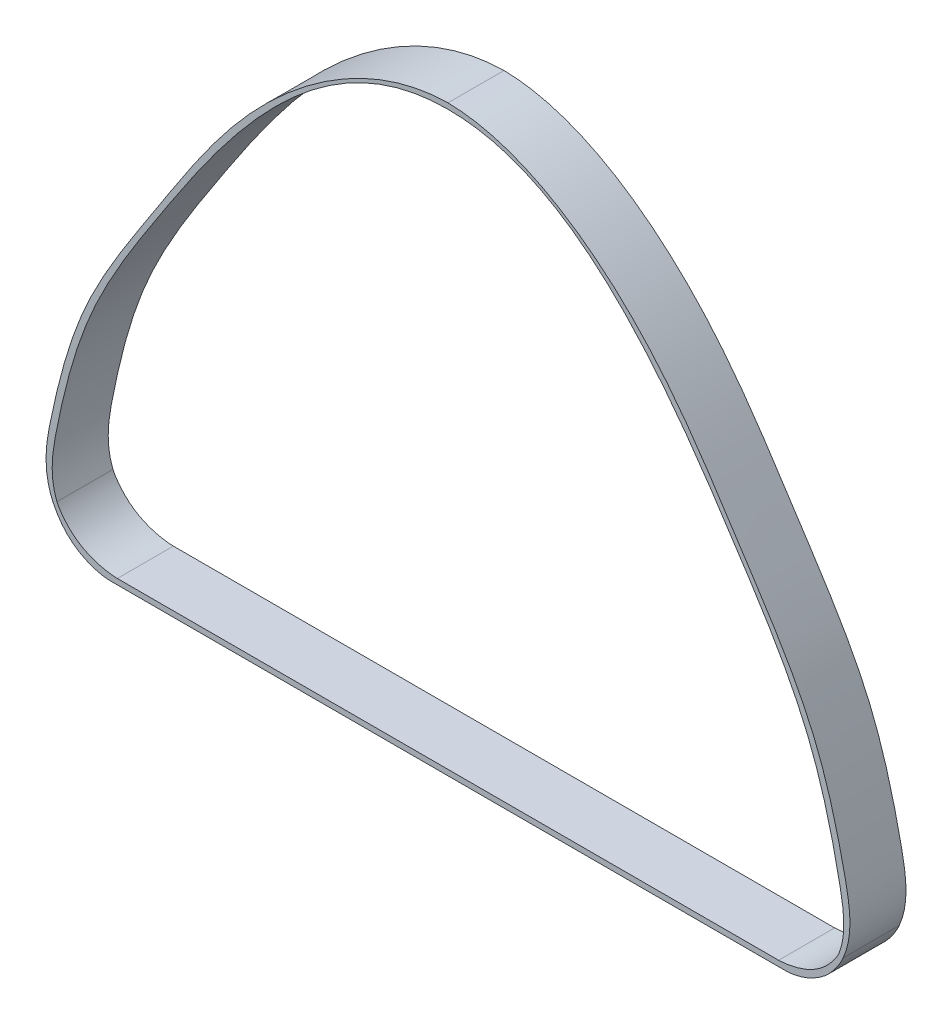
ISO-10303-21;
HEADER;
FILE_DESCRIPTION(('STEP AP214'),'2;1');
FILE_NAME('part.step','',(''),(''),'','','');
FILE_SCHEMA(('AUTOMOTIVE_DESIGN { 1 0 10303 214 1 1 1 1 }'));
ENDSEC;
DATA;
#1=APPLICATION_CONTEXT('core data for automotive mechanical design processes');
#2=APPLICATION_PROTOCOL_DEFINITION('international standard','automotive_design',2000,#1);
#3=PRODUCT_CONTEXT('',#1,'mechanical');
#4=PRODUCT('Part','Part','',(#3));
#5=PRODUCT_RELATED_PRODUCT_CATEGORY('part','',(#4));
#6=PRODUCT_DEFINITION_FORMATION('','',#4);
#7=PRODUCT_DEFINITION_CONTEXT('part definition',#1,'design');
#8=PRODUCT_DEFINITION('design','',#6,#7);
#9=PRODUCT_DEFINITION_SHAPE('','',#8);
#10=(LENGTH_UNIT() NAMED_UNIT(*) SI_UNIT(.MILLI.,.METRE.));
#11=(NAMED_UNIT(*) PLANE_ANGLE_UNIT() SI_UNIT($,.RADIAN.));
#12=(NAMED_UNIT(*) SI_UNIT($,.STERADIAN.) SOLID_ANGLE_UNIT());
#13=UNCERTAINTY_MEASURE_WITH_UNIT(LENGTH_MEASURE(1.E-05),#10,'distance_accuracy_value','');
#14=(GEOMETRIC_REPRESENTATION_CONTEXT(3) GLOBAL_UNCERTAINTY_ASSIGNED_CONTEXT((#13)) GLOBAL_UNIT_ASSIGNED_CONTEXT((#10,
#11,#12)) REPRESENTATION_CONTEXT('',''));
#15=CARTESIAN_POINT('',(0.,0.,0.));
#16=DIRECTION('',(0.,0.,1.));
#17=DIRECTION('',(1.,0.,0.));
#18=AXIS2_PLACEMENT_3D('',#15,#16,#17);
#19=CARTESIAN_POINT('',(24.6814928808751,12.8843236164375,5.));
#20=DIRECTION('',(0.,0.,1.));
#21=DIRECTION('',(1.,0.,0.));
#22=AXIS2_PLACEMENT_3D('',#19,#20,#21);
#23=PLANE('',#22);
#24=CARTESIAN_POINT('',(35.2584368437434,-16.4412791148118,5.));
#25=CARTESIAN_POINT('',(36.2300611856856,-14.2120162556952,5.));
#26=CARTESIAN_POINT('',(35.2635909123545,-8.86453883683733,5.));
#27=CARTESIAN_POINT('',(32.7911731615511,0.606888672938726,5.));
#28=CARTESIAN_POINT('',(25.7176322990285,11.1374464392121,5.));
#29=CARTESIAN_POINT('',(17.5035133605746,24.3306932764224,5.));
#30=CARTESIAN_POINT('',(6.52553134181208,31.9035956706368,5.));
#31=CARTESIAN_POINT('',(0.,32.,5.));
#32=B_SPLINE_CURVE_WITH_KNOTS('',3,(#24,#25,#26,#27,#28,#29,#30,#31),.UNSPECIFIED.,.F.,.F.,(4,1,
1,1,1,4),(0.,0.101815778200956,0.254593468675808,0.456472378289915,0.689238128462499,1.),.UNSPECIFIED.);
#33=CARTESIAN_POINT('',(35.2584368437434,-16.4412791148118,5.));
#34=VERTEX_POINT('',#33);
#35=CARTESIAN_POINT('',(0.,32.,5.));
#36=VERTEX_POINT('',#35);
#37=EDGE_CURVE('E224',#34,#36,#32,.T.);
#38=ORIENTED_EDGE('',*,*,#37,.T.);
#39=CARTESIAN_POINT('',(0.,32.,5.));
#40=CARTESIAN_POINT('',(-6.52553134181209,31.9035956706368,5.));
#41=CARTESIAN_POINT('',(-17.5035133605746,24.3306932764224,5.));
#42=CARTESIAN_POINT('',(-25.7176322990285,11.1374464392121,5.));
#43=CARTESIAN_POINT('',(-32.7911731615511,0.60688867293871,5.));
#44=CARTESIAN_POINT('',(-35.2635909123545,-8.86453883683735,5.));
#45=CARTESIAN_POINT('',(-36.2300611856856,-14.2120162556952,5.));
#46=CARTESIAN_POINT('',(-35.2584368437434,-16.4412791148118,5.));
#47=B_SPLINE_CURVE_WITH_KNOTS('',3,(#39,#40,#41,#42,#43,#44,#45,#46),.UNSPECIFIED.,.F.,.F.,(4,1,
1,1,1,4),(0.,0.310761871537501,0.543527621710084,0.745406531324192,0.898184221799044,1.),.UNSPECIFIED.);
#48=CARTESIAN_POINT('',(-35.2584368437434,-16.4412791148118,5.));
#49=VERTEX_POINT('',#48);
#50=EDGE_CURVE('E262',#36,#49,#47,.T.);
#51=ORIENTED_EDGE('',*,*,#50,.T.);
#52=CARTESIAN_POINT('',(-35.2584368437434,-16.4412791148118,5.));
#53=CARTESIAN_POINT('',(-34.9964434209078,-17.0209088515704,5.));
#54=CARTESIAN_POINT('',(-33.6905561455173,-19.1425610901067,5.));
#55=CARTESIAN_POINT('',(-31.1853546864803,-20.0293160233538,5.));
#56=CARTESIAN_POINT('',(-30.,-20.,5.));
#57=B_SPLINE_CURVE_WITH_KNOTS('',3,(#52,#53,#54,#55,#56),.UNSPECIFIED.,.F.,.F.,(4,1,4),(0.,
0.359900696386302,1.),.UNSPECIFIED.);
#58=CARTESIAN_POINT('',(-30.,-20.,5.));
#59=VERTEX_POINT('',#58);
#60=EDGE_CURVE('E246',#49,#59,#57,.T.);
#61=ORIENTED_EDGE('',*,*,#60,.T.);
#62=DIRECTION('',(1.,0.,0.));
#63=VECTOR('',#62,1.);
#64=CARTESIAN_POINT('',(-30.,-20.,5.));
#65=LINE('',#64,#63);
#66=CARTESIAN_POINT('',(30.,-20.,5.));
#67=VERTEX_POINT('',#66);
#68=EDGE_CURVE('E187',#59,#67,#65,.T.);
#69=ORIENTED_EDGE('',*,*,#68,.T.);
#70=CARTESIAN_POINT('',(30.,-20.,5.));
#71=CARTESIAN_POINT('',(31.1853546864803,-20.0293160233538,5.));
#72=CARTESIAN_POINT('',(33.6905561455173,-19.1425610901067,5.));
#73=CARTESIAN_POINT('',(34.9964434209078,-17.0209088515704,5.));
#74=CARTESIAN_POINT('',(35.2584368437434,-16.4412791148118,5.));
#75=B_SPLINE_CURVE_WITH_KNOTS('',3,(#70,#71,#72,#73,#74),.UNSPECIFIED.,.F.,.F.,(4,1,4),(0.,
0.640099303613698,1.),.UNSPECIFIED.);
#76=EDGE_CURVE('E179',#67,#34,#75,.T.);
#77=ORIENTED_EDGE('',*,*,#76,.T.);
#78=EDGE_LOOP('',(#38,#51,#61,#69,#77));
#79=FACE_BOUND('',#78,.T.);
#80=CARTESIAN_POINT('',(-34.8901272655465,-16.2695335379268,5.));
#81=CARTESIAN_POINT('',(-34.6657296001164,-16.7781174900036,5.));
#82=CARTESIAN_POINT('',(-33.0754771775325,-18.9212695446817,5.));
#83=CARTESIAN_POINT('',(-30.5488039096482,-19.479382043201,5.));
#84=CARTESIAN_POINT('',(-29.5,-19.5,5.));
#85=B_SPLINE_CURVE_WITH_KNOTS('',3,(#80,#81,#82,#83,#84),.UNSPECIFIED.,.F.,.F.,(4,1,4),(0.,
0.376949425999424,1.),.UNSPECIFIED.);
#86=CARTESIAN_POINT('',(-34.8901272655465,-16.2695335379268,5.));
#87=VERTEX_POINT('',#86);
#88=CARTESIAN_POINT('',(-29.5,-19.5,5.));
#89=VERTEX_POINT('',#88);
#90=EDGE_CURVE('E127',#87,#89,#85,.T.);
#91=ORIENTED_EDGE('',*,*,#90,.F.);
#92=CARTESIAN_POINT('',(0.,31.5,5.));
#93=CARTESIAN_POINT('',(-7.2551093928789,31.5111403772145,5.));
#94=CARTESIAN_POINT('',(-16.9533330913809,23.7158654788186,5.));
#95=CARTESIAN_POINT('',(-25.440161273381,10.9419992170632,5.));
#96=CARTESIAN_POINT('',(-32.2811165735658,0.338428352969211,5.));
#97=CARTESIAN_POINT('',(-34.6768934890413,-8.99115463249299,5.));
#98=CARTESIAN_POINT('',(-35.6048351831951,-14.4291149877429,5.));
#99=CARTESIAN_POINT('',(-34.8901272655465,-16.2695335379268,5.));
#100=B_SPLINE_CURVE_WITH_KNOTS('',3,(#92,#93,#94,#95,#96,#97,#98,#99),.UNSPECIFIED.,.F.,.F.,(4,
1,1,1,1,4),(0.,0.317686175826545,0.539497045980658,0.743916362264332,0.910983569282216,1.),.UNSPECIFIED.);
#101=CARTESIAN_POINT('',(0.,31.5,5.));
#102=VERTEX_POINT('',#101);
#103=EDGE_CURVE('E118',#102,#87,#100,.T.);
#104=ORIENTED_EDGE('',*,*,#103,.F.);
#105=CARTESIAN_POINT('',(34.8901272655465,-16.2695335379268,5.));
#106=CARTESIAN_POINT('',(35.6048351831951,-14.4291149877429,5.));
#107=CARTESIAN_POINT('',(34.6768934890413,-8.99115463249299,5.));
#108=CARTESIAN_POINT('',(32.2811165735658,0.338428352969214,5.));
#109=CARTESIAN_POINT('',(25.440161273381,10.9419992170632,5.));
#110=CARTESIAN_POINT('',(16.9533330913809,23.7158654788186,5.));
#111=CARTESIAN_POINT('',(7.25510939287889,31.5111403772145,5.));
#112=CARTESIAN_POINT('',(0.,31.5,5.));
#113=B_SPLINE_CURVE_WITH_KNOTS('',3,(#105,#106,#107,#108,#109,#110,#111,#112),.UNSPECIFIED.,.F.,
.F.,(4,1,1,1,1,4),(0.,0.0890164307177842,0.256083637735668,0.460502954019342,0.682313824173455,
1.),.UNSPECIFIED.);
#114=CARTESIAN_POINT('',(34.8901272655465,-16.2695335379268,5.));
#115=VERTEX_POINT('',#114);
#116=EDGE_CURVE('E298',#115,#102,#113,.T.);
#117=ORIENTED_EDGE('',*,*,#116,.F.);
#118=CARTESIAN_POINT('',(29.5,-19.5,5.));
#119=CARTESIAN_POINT('',(30.5488039096482,-19.479382043201,5.));
#120=CARTESIAN_POINT('',(33.0754771775325,-18.9212695446817,5.));
#121=CARTESIAN_POINT('',(34.6657296001164,-16.7781174900036,5.));
#122=CARTESIAN_POINT('',(34.8901272655465,-16.2695335379268,5.));
#123=B_SPLINE_CURVE_WITH_KNOTS('',3,(#118,#119,#120,#121,#122),.UNSPECIFIED.,.F.,.F.,(4,1,4),
(0.,0.623050574000576,1.),.UNSPECIFIED.);
#124=CARTESIAN_POINT('',(29.5,-19.5,5.));
#125=VERTEX_POINT('',#124);
#126=EDGE_CURVE('E145',#125,#115,#123,.T.);
#127=ORIENTED_EDGE('',*,*,#126,.F.);
#128=DIRECTION('',(1.,0.,0.));
#129=VECTOR('',#128,1.);
#130=CARTESIAN_POINT('',(-29.5,-19.5,5.));
#131=LINE('',#130,#129);
#132=EDGE_CURVE('E141',#89,#125,#131,.T.);
#133=ORIENTED_EDGE('',*,*,#132,.F.);
#134=EDGE_LOOP('',(#91,#104,#117,#127,#133));
#135=FACE_BOUND('',#134,.T.);
#136=ADVANCED_FACE('F39',(#79,#135),#23,.T.);
#137=CARTESIAN_POINT('',(24.6814928808751,12.8843236164375,0.));
#138=DIRECTION('',(0.,0.,1.));
#139=DIRECTION('',(1.,0.,0.));
#140=AXIS2_PLACEMENT_3D('',#137,#138,#139);
#141=PLANE('',#140);
#142=CARTESIAN_POINT('',(35.2584368437434,-16.4412791148118,0.));
#143=CARTESIAN_POINT('',(36.2300611856856,-14.2120162556952,0.));
#144=CARTESIAN_POINT('',(35.2635909123545,-8.86453883683733,0.));
#145=CARTESIAN_POINT('',(32.7911731615511,0.606888672938726,0.));
#146=CARTESIAN_POINT('',(25.7176322990285,11.1374464392121,0.));
#147=CARTESIAN_POINT('',(17.5035133605746,24.3306932764224,0.));
#148=CARTESIAN_POINT('',(6.52553134181208,31.9035956706368,0.));
#149=CARTESIAN_POINT('',(0.,32.,0.));
#150=B_SPLINE_CURVE_WITH_KNOTS('',3,(#142,#143,#144,#145,#146,#147,#148,#149),.UNSPECIFIED.,.F.,
.F.,(4,1,1,1,1,4),(0.,0.101815778200956,0.254593468675808,0.456472378289915,0.689238128462499,
1.),.UNSPECIFIED.);
#151=CARTESIAN_POINT('',(35.2584368437434,-16.4412791148118,0.));
#152=VERTEX_POINT('',#151);
#153=CARTESIAN_POINT('',(0.,32.,0.));
#154=VERTEX_POINT('',#153);
#155=EDGE_CURVE('E136',#152,#154,#150,.T.);
#156=ORIENTED_EDGE('',*,*,#155,.F.);
#157=CARTESIAN_POINT('',(30.,-20.,0.));
#158=CARTESIAN_POINT('',(31.1853546864803,-20.0293160233538,0.));
#159=CARTESIAN_POINT('',(33.6905561455173,-19.1425610901067,0.));
#160=CARTESIAN_POINT('',(34.9964434209078,-17.0209088515704,0.));
#161=CARTESIAN_POINT('',(35.2584368437434,-16.4412791148118,0.));
#162=B_SPLINE_CURVE_WITH_KNOTS('',3,(#157,#158,#159,#160,#161),.UNSPECIFIED.,.F.,.F.,(4,1,4),
(0.,0.640099303613698,1.),.UNSPECIFIED.);
#163=CARTESIAN_POINT('',(30.,-20.,0.));
#164=VERTEX_POINT('',#163);
#165=EDGE_CURVE('E219',#164,#152,#162,.T.);
#166=ORIENTED_EDGE('',*,*,#165,.F.);
#167=DIRECTION('',(1.,0.,0.));
#168=VECTOR('',#167,1.);
#169=CARTESIAN_POINT('',(-30.,-20.,0.));
#170=LINE('',#169,#168);
#171=CARTESIAN_POINT('',(-30.,-20.,0.));
#172=VERTEX_POINT('',#171);
#173=EDGE_CURVE('E213',#172,#164,#170,.T.);
#174=ORIENTED_EDGE('',*,*,#173,.F.);
#175=CARTESIAN_POINT('',(-35.2584368437434,-16.4412791148118,0.));
#176=CARTESIAN_POINT('',(-34.9964434209078,-17.0209088515704,0.));
#177=CARTESIAN_POINT('',(-33.6905561455173,-19.1425610901067,0.));
#178=CARTESIAN_POINT('',(-31.1853546864803,-20.0293160233538,0.));
#179=CARTESIAN_POINT('',(-30.,-20.,0.));
#180=B_SPLINE_CURVE_WITH_KNOTS('',3,(#175,#176,#177,#178,#179),.UNSPECIFIED.,.F.,.F.,(4,1,4),
(0.,0.359900696386302,1.),.UNSPECIFIED.);
#181=CARTESIAN_POINT('',(-35.2584368437434,-16.4412791148118,0.));
#182=VERTEX_POINT('',#181);
#183=EDGE_CURVE('E205',#182,#172,#180,.T.);
#184=ORIENTED_EDGE('',*,*,#183,.F.);
#185=CARTESIAN_POINT('',(0.,32.,0.));
#186=CARTESIAN_POINT('',(-6.52553134181209,31.9035956706368,0.));
#187=CARTESIAN_POINT('',(-17.5035133605746,24.3306932764224,0.));
#188=CARTESIAN_POINT('',(-25.7176322990285,11.1374464392121,0.));
#189=CARTESIAN_POINT('',(-32.7911731615511,0.60688867293871,0.));
#190=CARTESIAN_POINT('',(-35.2635909123545,-8.86453883683735,0.));
#191=CARTESIAN_POINT('',(-36.2300611856856,-14.2120162556952,0.));
#192=CARTESIAN_POINT('',(-35.2584368437434,-16.4412791148118,0.));
#193=B_SPLINE_CURVE_WITH_KNOTS('',3,(#185,#186,#187,#188,#189,#190,#191,#192),.UNSPECIFIED.,.F.,
.F.,(4,1,1,1,1,4),(0.,0.310761871537501,0.543527621710084,0.745406531324192,0.898184221799044,
1.),.UNSPECIFIED.);
#194=EDGE_CURVE('E197',#154,#182,#193,.T.);
#195=ORIENTED_EDGE('',*,*,#194,.F.);
#196=EDGE_LOOP('',(#156,#166,#174,#184,#195));
#197=FACE_BOUND('',#196,.T.);
#198=CARTESIAN_POINT('',(0.,31.5,0.));
#199=CARTESIAN_POINT('',(-7.2551093928789,31.5111403772145,0.));
#200=CARTESIAN_POINT('',(-16.9533330913809,23.7158654788186,0.));
#201=CARTESIAN_POINT('',(-25.440161273381,10.9419992170632,0.));
#202=CARTESIAN_POINT('',(-32.2811165735658,0.338428352969211,0.));
#203=CARTESIAN_POINT('',(-34.6768934890413,-8.99115463249299,0.));
#204=CARTESIAN_POINT('',(-35.6048351831951,-14.4291149877429,0.));
#205=CARTESIAN_POINT('',(-34.8901272655465,-16.2695335379268,0.));
#206=B_SPLINE_CURVE_WITH_KNOTS('',3,(#198,#199,#200,#201,#202,#203,#204,#205),.UNSPECIFIED.,.F.,
.F.,(4,1,1,1,1,4),(0.,0.317686175826545,0.539497045980658,0.743916362264332,0.910983569282216,
1.),.UNSPECIFIED.);
#207=CARTESIAN_POINT('',(0.,31.5,0.));
#208=VERTEX_POINT('',#207);
#209=CARTESIAN_POINT('',(-34.8901272655465,-16.2695335379268,0.));
#210=VERTEX_POINT('',#209);
#211=EDGE_CURVE('E64',#208,#210,#206,.T.);
#212=ORIENTED_EDGE('',*,*,#211,.T.);
#213=CARTESIAN_POINT('',(-34.8901272655465,-16.2695335379268,0.));
#214=CARTESIAN_POINT('',(-34.6657296001164,-16.7781174900036,0.));
#215=CARTESIAN_POINT('',(-33.0754771775325,-18.9212695446817,0.));
#216=CARTESIAN_POINT('',(-30.5488039096482,-19.479382043201,0.));
#217=CARTESIAN_POINT('',(-29.5,-19.5,0.));
#218=B_SPLINE_CURVE_WITH_KNOTS('',3,(#213,#214,#215,#216,#217),.UNSPECIFIED.,.F.,.F.,(4,1,4),
(0.,0.376949425999424,1.),.UNSPECIFIED.);
#219=CARTESIAN_POINT('',(-29.5,-19.5,0.));
#220=VERTEX_POINT('',#219);
#221=EDGE_CURVE('E134',#210,#220,#218,.T.);
#222=ORIENTED_EDGE('',*,*,#221,.T.);
#223=DIRECTION('',(1.,0.,0.));
#224=VECTOR('',#223,1.);
#225=CARTESIAN_POINT('',(-29.5,-19.5,0.));
#226=LINE('',#225,#224);
#227=CARTESIAN_POINT('',(29.5,-19.5,0.));
#228=VERTEX_POINT('',#227);
#229=EDGE_CURVE('E313',#220,#228,#226,.T.);
#230=ORIENTED_EDGE('',*,*,#229,.T.);
#231=CARTESIAN_POINT('',(29.5,-19.5,0.));
#232=CARTESIAN_POINT('',(30.5488039096482,-19.479382043201,0.));
#233=CARTESIAN_POINT('',(33.0754771775325,-18.9212695446817,0.));
#234=CARTESIAN_POINT('',(34.6657296001164,-16.7781174900036,0.));
#235=CARTESIAN_POINT('',(34.8901272655465,-16.2695335379268,0.));
#236=B_SPLINE_CURVE_WITH_KNOTS('',3,(#231,#232,#233,#234,#235),.UNSPECIFIED.,.F.,.F.,(4,1,4),
(0.,0.623050574000576,1.),.UNSPECIFIED.);
#237=CARTESIAN_POINT('',(34.8901272655465,-16.2695335379268,0.));
#238=VERTEX_POINT('',#237);
#239=EDGE_CURVE('E304',#228,#238,#236,.T.);
#240=ORIENTED_EDGE('',*,*,#239,.T.);
#241=CARTESIAN_POINT('',(34.8901272655465,-16.2695335379268,0.));
#242=CARTESIAN_POINT('',(35.6048351831951,-14.4291149877429,0.));
#243=CARTESIAN_POINT('',(34.6768934890413,-8.99115463249299,0.));
#244=CARTESIAN_POINT('',(32.2811165735658,0.338428352969214,0.));
#245=CARTESIAN_POINT('',(25.440161273381,10.9419992170632,0.));
#246=CARTESIAN_POINT('',(16.9533330913809,23.7158654788186,0.));
#247=CARTESIAN_POINT('',(7.25510939287889,31.5111403772145,0.));
#248=CARTESIAN_POINT('',(0.,31.5,0.));
#249=B_SPLINE_CURVE_WITH_KNOTS('',3,(#241,#242,#243,#244,#245,#246,#247,#248),.UNSPECIFIED.,.F.,
.F.,(4,1,1,1,1,4),(0.,0.0890164307177842,0.256083637735668,0.460502954019342,0.682313824173455,
1.),.UNSPECIFIED.);
#250=EDGE_CURVE('E128',#238,#208,#249,.T.);
#251=ORIENTED_EDGE('',*,*,#250,.T.);
#252=EDGE_LOOP('',(#212,#222,#230,#240,#251));
#253=FACE_BOUND('',#252,.T.);
#254=ADVANCED_FACE('F168',(#197,#253),#141,.F.);
#255=DIRECTION('',(0.,0.,-1.));
#256=VECTOR('',#255,1.);
#257=SURFACE_OF_LINEAR_EXTRUSION('',#32,#256);
#258=ORIENTED_EDGE('',*,*,#155,.T.);
#259=DIRECTION('',(0.,0.,-1.));
#260=VECTOR('',#259,1.);
#261=CARTESIAN_POINT('',(0.,32.,5.));
#262=LINE('',#261,#260);
#263=EDGE_CURVE('E11',#36,#154,#262,.T.);
#264=ORIENTED_EDGE('',*,*,#263,.F.);
#265=ORIENTED_EDGE('',*,*,#37,.F.);
#266=DIRECTION('',(0.,0.,-1.));
#267=VECTOR('',#266,1.);
#268=CARTESIAN_POINT('',(35.2584368437434,-16.4412791148118,5.));
#269=LINE('',#268,#267);
#270=EDGE_CURVE('E186',#34,#152,#269,.T.);
#271=ORIENTED_EDGE('',*,*,#270,.T.);
#272=EDGE_LOOP('',(#258,#264,#265,#271));
#273=FACE_BOUND('',#272,.T.);
#274=ADVANCED_FACE('F41',(#273),#257,.F.);
#275=DIRECTION('',(0.,0.,-1.));
#276=VECTOR('',#275,1.);
#277=SURFACE_OF_LINEAR_EXTRUSION('',#47,#276);
#278=ORIENTED_EDGE('',*,*,#194,.T.);
#279=DIRECTION('',(0.,0.,-1.));
#280=VECTOR('',#279,1.);
#281=CARTESIAN_POINT('',(-35.2584368437434,-16.4412791148118,5.));
#282=LINE('',#281,#280);
#283=EDGE_CURVE('E49',#49,#182,#282,.T.);
#284=ORIENTED_EDGE('',*,*,#283,.F.);
#285=ORIENTED_EDGE('',*,*,#50,.F.);
#286=ORIENTED_EDGE('',*,*,#263,.T.);
#287=EDGE_LOOP('',(#278,#284,#285,#286));
#288=FACE_BOUND('',#287,.T.);
#289=ADVANCED_FACE('F275',(#288),#277,.F.);
#290=DIRECTION('',(0.,0.,-1.));
#291=VECTOR('',#290,1.);
#292=SURFACE_OF_LINEAR_EXTRUSION('',#57,#291);
#293=ORIENTED_EDGE('',*,*,#183,.T.);
#294=DIRECTION('',(0.,0.,-1.));
#295=VECTOR('',#294,1.);
#296=CARTESIAN_POINT('',(-30.,-20.,5.));
#297=LINE('',#296,#295);
#298=EDGE_CURVE('E235',#59,#172,#297,.T.);
#299=ORIENTED_EDGE('',*,*,#298,.F.);
#300=ORIENTED_EDGE('',*,*,#60,.F.);
#301=ORIENTED_EDGE('',*,*,#283,.T.);
#302=EDGE_LOOP('',(#293,#299,#300,#301));
#303=FACE_BOUND('',#302,.T.);
#304=ADVANCED_FACE('F244',(#303),#292,.F.);
#305=CARTESIAN_POINT('',(-30.,-20.,5.));
#306=DIRECTION('',(0.,1.,0.));
#307=DIRECTION('',(-1.,0.,0.));
#308=AXIS2_PLACEMENT_3D('',#305,#306,#307);
#309=PLANE('',#308);
#310=ORIENTED_EDGE('',*,*,#173,.T.);
#311=DIRECTION('',(0.,0.,-1.));
#312=VECTOR('',#311,1.);
#313=CARTESIAN_POINT('',(30.,-20.,5.));
#314=LINE('',#313,#312);
#315=EDGE_CURVE('E231',#67,#164,#314,.T.);
#316=ORIENTED_EDGE('',*,*,#315,.F.);
#317=ORIENTED_EDGE('',*,*,#68,.F.);
#318=ORIENTED_EDGE('',*,*,#298,.T.);
#319=EDGE_LOOP('',(#310,#316,#317,#318));
#320=FACE_BOUND('',#319,.T.);
#321=ADVANCED_FACE('F176',(#320),#309,.F.);
#322=DIRECTION('',(0.,0.,-1.));
#323=VECTOR('',#322,1.);
#324=SURFACE_OF_LINEAR_EXTRUSION('',#75,#323);
#325=ORIENTED_EDGE('',*,*,#165,.T.);
#326=ORIENTED_EDGE('',*,*,#270,.F.);
#327=ORIENTED_EDGE('',*,*,#76,.F.);
#328=ORIENTED_EDGE('',*,*,#315,.T.);
#329=EDGE_LOOP('',(#325,#326,#327,#328));
#330=FACE_BOUND('',#329,.T.);
#331=ADVANCED_FACE('F165',(#330),#324,.F.);
#332=DIRECTION('',(0.,0.,-1.));
#333=VECTOR('',#332,1.);
#334=SURFACE_OF_LINEAR_EXTRUSION('',#100,#333);
#335=ORIENTED_EDGE('',*,*,#211,.F.);
#336=DIRECTION('',(0.,0.,-1.));
#337=VECTOR('',#336,1.);
#338=CARTESIAN_POINT('',(0.,31.5,5.));
#339=LINE('',#338,#337);
#340=EDGE_CURVE('E122',#102,#208,#339,.T.);
#341=ORIENTED_EDGE('',*,*,#340,.F.);
#342=ORIENTED_EDGE('',*,*,#103,.T.);
#343=DIRECTION('',(0.,0.,-1.));
#344=VECTOR('',#343,1.);
#345=CARTESIAN_POINT('',(-34.8901272655465,-16.2695335379268,5.));
#346=LINE('',#345,#344);
#347=EDGE_CURVE('E121',#87,#210,#346,.T.);
#348=ORIENTED_EDGE('',*,*,#347,.T.);
#349=EDGE_LOOP('',(#335,#341,#342,#348));
#350=FACE_BOUND('',#349,.T.);
#351=ADVANCED_FACE('F120',(#350),#334,.T.);
#352=DIRECTION('',(0.,0.,-1.));
#353=VECTOR('',#352,1.);
#354=SURFACE_OF_LINEAR_EXTRUSION('',#85,#353);
#355=ORIENTED_EDGE('',*,*,#221,.F.);
#356=ORIENTED_EDGE('',*,*,#347,.F.);
#357=ORIENTED_EDGE('',*,*,#90,.T.);
#358=DIRECTION('',(0.,0.,-1.));
#359=VECTOR('',#358,1.);
#360=CARTESIAN_POINT('',(-29.5,-19.5,5.));
#361=LINE('',#360,#359);
#362=EDGE_CURVE('E137',#89,#220,#361,.T.);
#363=ORIENTED_EDGE('',*,*,#362,.T.);
#364=EDGE_LOOP('',(#355,#356,#357,#363));
#365=FACE_BOUND('',#364,.T.);
#366=ADVANCED_FACE('F131',(#365),#354,.T.);
#367=CARTESIAN_POINT('',(-29.5,-19.5,5.));
#368=DIRECTION('',(0.,1.,0.));
#369=DIRECTION('',(-1.,0.,0.));
#370=AXIS2_PLACEMENT_3D('',#367,#368,#369);
#371=PLANE('',#370);
#372=ORIENTED_EDGE('',*,*,#229,.F.);
#373=ORIENTED_EDGE('',*,*,#362,.F.);
#374=ORIENTED_EDGE('',*,*,#132,.T.);
#375=DIRECTION('',(0.,0.,-1.));
#376=VECTOR('',#375,1.);
#377=CARTESIAN_POINT('',(29.5,-19.5,5.));
#378=LINE('',#377,#376);
#379=EDGE_CURVE('E291',#125,#228,#378,.T.);
#380=ORIENTED_EDGE('',*,*,#379,.T.);
#381=EDGE_LOOP('',(#372,#373,#374,#380));
#382=FACE_BOUND('',#381,.T.);
#383=ADVANCED_FACE('F161',(#382),#371,.T.);
#384=DIRECTION('',(0.,0.,-1.));
#385=VECTOR('',#384,1.);
#386=SURFACE_OF_LINEAR_EXTRUSION('',#123,#385);
#387=ORIENTED_EDGE('',*,*,#239,.F.);
#388=ORIENTED_EDGE('',*,*,#379,.F.);
#389=ORIENTED_EDGE('',*,*,#126,.T.);
#390=DIRECTION('',(0.,0.,-1.));
#391=VECTOR('',#390,1.);
#392=CARTESIAN_POINT('',(34.8901272655465,-16.2695335379268,5.));
#393=LINE('',#392,#391);
#394=EDGE_CURVE('E56',#115,#238,#393,.T.);
#395=ORIENTED_EDGE('',*,*,#394,.T.);
#396=EDGE_LOOP('',(#387,#388,#389,#395));
#397=FACE_BOUND('',#396,.T.);
#398=ADVANCED_FACE('F347',(#397),#386,.T.);
#399=DIRECTION('',(0.,0.,-1.));
#400=VECTOR('',#399,1.);
#401=SURFACE_OF_LINEAR_EXTRUSION('',#113,#400);
#402=ORIENTED_EDGE('',*,*,#250,.F.);
#403=ORIENTED_EDGE('',*,*,#394,.F.);
#404=ORIENTED_EDGE('',*,*,#116,.T.);
#405=ORIENTED_EDGE('',*,*,#340,.T.);
#406=EDGE_LOOP('',(#402,#403,#404,#405));
#407=FACE_BOUND('',#406,.T.);
#408=ADVANCED_FACE('F345',(#407),#401,.T.);
#409=CLOSED_SHELL('',(#136,#254,#274,#289,#304,#321,#331,#351,#366,#383,#398,#408));
#410=MANIFOLD_SOLID_BREP('B2',#409);
#411=ADVANCED_BREP_SHAPE_REPRESENTATION('',(#18,#410),#14);
#412=SHAPE_DEFINITION_REPRESENTATION(#9,#411);
ENDSEC;
END-ISO-10303-21;
